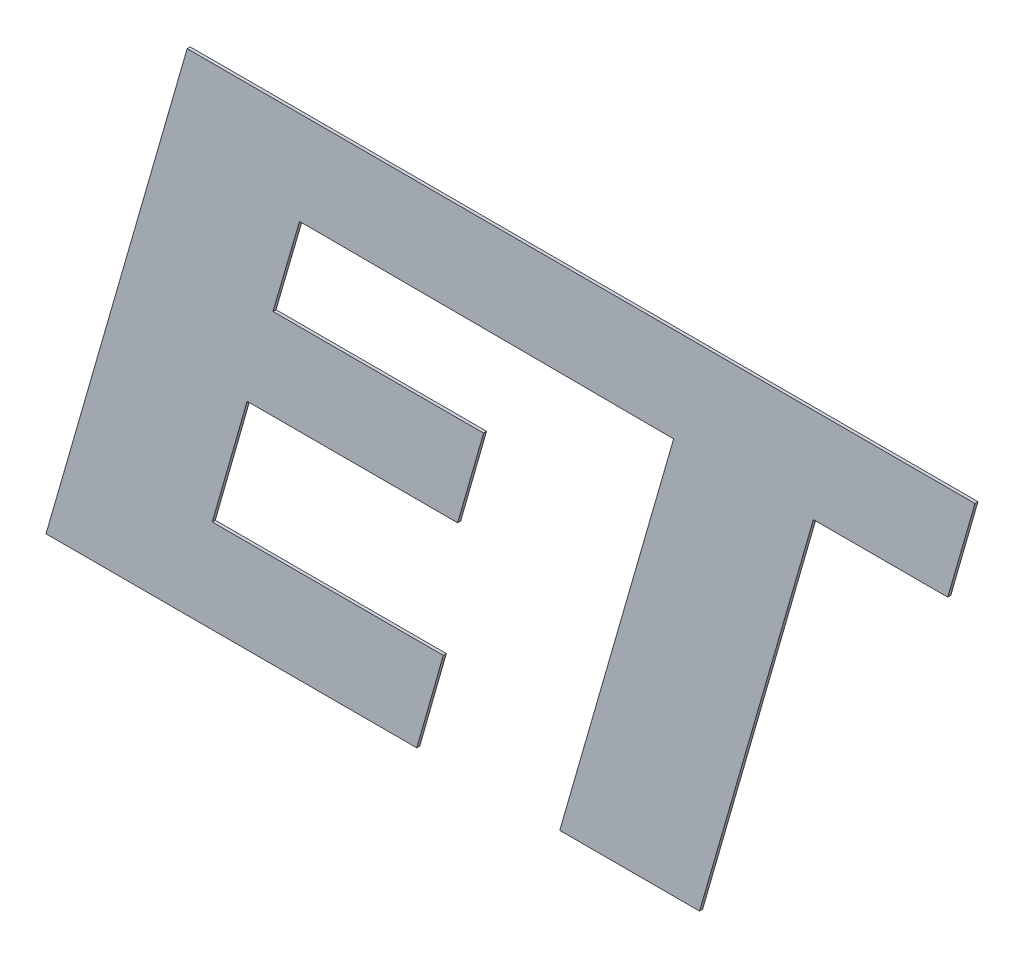
ISO-10303-21;
HEADER;
FILE_DESCRIPTION(('STEP AP214'),'2;1');
FILE_NAME('part.step','',(''),(''),'','','');
FILE_SCHEMA(('AUTOMOTIVE_DESIGN { 1 0 10303 214 1 1 1 1 }'));
ENDSEC;
DATA;
#1=APPLICATION_CONTEXT('core data for automotive mechanical design processes');
#2=APPLICATION_PROTOCOL_DEFINITION('international standard','automotive_design',2000,#1);
#3=PRODUCT_CONTEXT('',#1,'mechanical');
#4=PRODUCT('Part','Part','',(#3));
#5=PRODUCT_RELATED_PRODUCT_CATEGORY('part','',(#4));
#6=PRODUCT_DEFINITION_FORMATION('','',#4);
#7=PRODUCT_DEFINITION_CONTEXT('part definition',#1,'design');
#8=PRODUCT_DEFINITION('design','',#6,#7);
#9=PRODUCT_DEFINITION_SHAPE('','',#8);
#10=(LENGTH_UNIT() NAMED_UNIT(*) SI_UNIT(.MILLI.,.METRE.));
#11=(NAMED_UNIT(*) PLANE_ANGLE_UNIT() SI_UNIT($,.RADIAN.));
#12=(NAMED_UNIT(*) SI_UNIT($,.STERADIAN.) SOLID_ANGLE_UNIT());
#13=UNCERTAINTY_MEASURE_WITH_UNIT(LENGTH_MEASURE(1.E-05),#10,'distance_accuracy_value','');
#14=(GEOMETRIC_REPRESENTATION_CONTEXT(3) GLOBAL_UNCERTAINTY_ASSIGNED_CONTEXT((#13)) GLOBAL_UNIT_ASSIGNED_CONTEXT((#10,
#11,#12)) REPRESENTATION_CONTEXT('',''));
#15=CARTESIAN_POINT('',(0.,0.,0.));
#16=DIRECTION('',(0.,0.,1.));
#17=DIRECTION('',(1.,0.,0.));
#18=AXIS2_PLACEMENT_3D('',#15,#16,#17);
#19=CARTESIAN_POINT('',(4.5494598303716,3.44987790081049,2.505));
#20=DIRECTION('',(0.00281330167602132,0.99999604265901,0.));
#21=DIRECTION('',(0.,0.,-1.));
#22=AXIS2_PLACEMENT_3D('',#19,#20,#21);
#23=PLANE('',#22);
#24=DIRECTION('',(0.99999604265901,-0.00281330167602132,0.));
#25=VECTOR('',#24,1.);
#26=CARTESIAN_POINT('',(4.5494598303716,3.44987790081049,2.5));
#27=LINE('',#26,#25);
#28=CARTESIAN_POINT('',(4.5494598303716,3.44987790081049,2.5));
#29=VERTEX_POINT('',#28);
#30=CARTESIAN_POINT('',(4.91902481999534,3.44883819889133,2.5));
#31=VERTEX_POINT('',#30);
#32=EDGE_CURVE('E10',#29,#31,#27,.T.);
#33=ORIENTED_EDGE('',*,*,#32,.T.);
#34=DIRECTION('',(0.,0.,-1.));
#35=VECTOR('',#34,1.);
#36=CARTESIAN_POINT('',(4.91902481999534,3.44883819889133,2.505));
#37=LINE('',#36,#35);
#38=CARTESIAN_POINT('',(4.91902481999534,3.44883819889133,2.505));
#39=VERTEX_POINT('',#38);
#40=EDGE_CURVE('E42',#39,#31,#37,.T.);
#41=ORIENTED_EDGE('',*,*,#40,.F.);
#42=DIRECTION('',(0.99999604265901,-0.00281330167602132,0.));
#43=VECTOR('',#42,1.);
#44=CARTESIAN_POINT('',(4.5494598303716,3.44987790081049,2.505));
#45=LINE('',#44,#43);
#46=CARTESIAN_POINT('',(4.5494598303716,3.44987790081049,2.505));
#47=VERTEX_POINT('',#46);
#48=EDGE_CURVE('E274',#47,#39,#45,.T.);
#49=ORIENTED_EDGE('',*,*,#48,.F.);
#50=DIRECTION('',(0.,0.,-1.));
#51=VECTOR('',#50,1.);
#52=CARTESIAN_POINT('',(4.5494598303716,3.44987790081049,2.505));
#53=LINE('',#52,#51);
#54=EDGE_CURVE('E27',#47,#29,#53,.T.);
#55=ORIENTED_EDGE('',*,*,#54,.T.);
#56=EDGE_LOOP('',(#33,#41,#49,#55));
#57=FACE_BOUND('',#56,.T.);
#58=ADVANCED_FACE('F16',(#57),#23,.F.);
#59=CARTESIAN_POINT('',(4.91902481999534,3.44883819889133,2.505));
#60=DIRECTION('',(0.00465069382367867,0.999989185465002,0.));
#61=DIRECTION('',(0.,0.,-1.));
#62=AXIS2_PLACEMENT_3D('',#59,#60,#61);
#63=PLANE('',#62);
#64=DIRECTION('',(0.999989185465002,-0.00465069382367867,0.));
#65=VECTOR('',#64,1.);
#66=CARTESIAN_POINT('',(4.91902481999534,3.44883819889133,2.5));
#67=LINE('',#66,#65);
#68=CARTESIAN_POINT('',(5.16419830268063,3.44769795975852,2.5));
#69=VERTEX_POINT('',#68);
#70=EDGE_CURVE('E315',#31,#69,#67,.T.);
#71=ORIENTED_EDGE('',*,*,#70,.T.);
#72=DIRECTION('',(0.,0.,-1.));
#73=VECTOR('',#72,1.);
#74=CARTESIAN_POINT('',(5.16419830268063,3.44769795975852,2.505));
#75=LINE('',#74,#73);
#76=CARTESIAN_POINT('',(5.16419830268063,3.44769795975852,2.505));
#77=VERTEX_POINT('',#76);
#78=EDGE_CURVE('E233',#77,#69,#75,.T.);
#79=ORIENTED_EDGE('',*,*,#78,.F.);
#80=DIRECTION('',(0.999989185465002,-0.00465069382367867,0.));
#81=VECTOR('',#80,1.);
#82=CARTESIAN_POINT('',(4.91902481999534,3.44883819889133,2.505));
#83=LINE('',#82,#81);
#84=EDGE_CURVE('E271',#39,#77,#83,.T.);
#85=ORIENTED_EDGE('',*,*,#84,.F.);
#86=ORIENTED_EDGE('',*,*,#40,.T.);
#87=EDGE_LOOP('',(#71,#79,#85,#86));
#88=FACE_BOUND('',#87,.T.);
#89=ADVANCED_FACE('F428',(#88),#63,.F.);
#90=CARTESIAN_POINT('',(5.16419830268063,3.44769795975852,2.505));
#91=DIRECTION('',(0.961066454899901,-0.276317334356962,0.));
#92=DIRECTION('',(0.,0.,-1.));
#93=AXIS2_PLACEMENT_3D('',#90,#91,#92);
#94=PLANE('',#93);
#95=DIRECTION('',(-0.276317334356962,-0.961066454899901,0.));
#96=VECTOR('',#95,1.);
#97=CARTESIAN_POINT('',(5.16419830268063,3.44769795975852,2.5));
#98=LINE('',#97,#96);
#99=CARTESIAN_POINT('',(4.977100999823,2.79695,2.5));
#100=VERTEX_POINT('',#99);
#101=EDGE_CURVE('E306',#69,#100,#98,.T.);
#102=ORIENTED_EDGE('',*,*,#101,.T.);
#103=DIRECTION('',(0.,0.,-1.));
#104=VECTOR('',#103,1.);
#105=CARTESIAN_POINT('',(4.977100999823,2.79695,2.505));
#106=LINE('',#105,#104);
#107=CARTESIAN_POINT('',(4.977100999823,2.79695,2.505));
#108=VERTEX_POINT('',#107);
#109=EDGE_CURVE('E225',#108,#100,#106,.T.);
#110=ORIENTED_EDGE('',*,*,#109,.F.);
#111=DIRECTION('',(-0.276317334356962,-0.961066454899901,0.));
#112=VECTOR('',#111,1.);
#113=CARTESIAN_POINT('',(5.16419830268063,3.44769795975852,2.505));
#114=LINE('',#113,#112);
#115=EDGE_CURVE('E275',#77,#108,#114,.T.);
#116=ORIENTED_EDGE('',*,*,#115,.F.);
#117=ORIENTED_EDGE('',*,*,#78,.T.);
#118=EDGE_LOOP('',(#102,#110,#116,#117));
#119=FACE_BOUND('',#118,.T.);
#120=ADVANCED_FACE('F433',(#119),#94,.F.);
#121=CARTESIAN_POINT('',(4.977100999823,2.79695,2.505));
#122=DIRECTION('',(0.,1.,0.));
#123=DIRECTION('',(1.,0.,0.));
#124=AXIS2_PLACEMENT_3D('',#121,#122,#123);
#125=PLANE('',#124);
#126=DIRECTION('',(1.,0.,0.));
#127=VECTOR('',#126,1.);
#128=CARTESIAN_POINT('',(4.977100999823,2.79695,2.5));
#129=LINE('',#128,#127);
#130=CARTESIAN_POINT('',(5.20683098560959,2.79695,2.5));
#131=VERTEX_POINT('',#130);
#132=EDGE_CURVE('E229',#100,#131,#129,.T.);
#133=ORIENTED_EDGE('',*,*,#132,.T.);
#134=DIRECTION('',(0.,0.,-1.));
#135=VECTOR('',#134,1.);
#136=CARTESIAN_POINT('',(5.20683098560959,2.79695,2.505));
#137=LINE('',#136,#135);
#138=CARTESIAN_POINT('',(5.20683098560959,2.79695,2.505));
#139=VERTEX_POINT('',#138);
#140=EDGE_CURVE('E237',#139,#131,#137,.T.);
#141=ORIENTED_EDGE('',*,*,#140,.F.);
#142=DIRECTION('',(1.,0.,0.));
#143=VECTOR('',#142,1.);
#144=CARTESIAN_POINT('',(4.977100999823,2.79695,2.505));
#145=LINE('',#144,#143);
#146=EDGE_CURVE('E276',#108,#139,#145,.T.);
#147=ORIENTED_EDGE('',*,*,#146,.F.);
#148=ORIENTED_EDGE('',*,*,#109,.T.);
#149=EDGE_LOOP('',(#133,#141,#147,#148));
#150=FACE_BOUND('',#149,.T.);
#151=ADVANCED_FACE('F438',(#150),#125,.F.);
#152=CARTESIAN_POINT('',(5.20683098560959,2.79695,2.505));
#153=DIRECTION('',(-0.961087610217285,0.276243742891722,0.));
#154=DIRECTION('',(0.,0.,1.));
#155=AXIS2_PLACEMENT_3D('',#152,#153,#154);
#156=PLANE('',#155);
#157=DIRECTION('',(0.276243742891722,0.961087610217285,0.));
#158=VECTOR('',#157,1.);
#159=CARTESIAN_POINT('',(5.20683098560959,2.79695,2.5));
#160=LINE('',#159,#158);
#161=CARTESIAN_POINT('',(5.39387434166915,3.44769795975651,2.5));
#162=VERTEX_POINT('',#161);
#163=EDGE_CURVE('E234',#131,#162,#160,.T.);
#164=ORIENTED_EDGE('',*,*,#163,.T.);
#165=DIRECTION('',(0.,0.,-1.));
#166=VECTOR('',#165,1.);
#167=CARTESIAN_POINT('',(5.39387434166915,3.44769795975651,2.505));
#168=LINE('',#167,#166);
#169=CARTESIAN_POINT('',(5.39387434166915,3.44769795975651,2.505));
#170=VERTEX_POINT('',#169);
#171=EDGE_CURVE('E268',#170,#162,#168,.T.);
#172=ORIENTED_EDGE('',*,*,#171,.F.);
#173=DIRECTION('',(0.276243742891722,0.961087610217285,0.));
#174=VECTOR('',#173,1.);
#175=CARTESIAN_POINT('',(5.20683098560959,2.79695,2.505));
#176=LINE('',#175,#174);
#177=EDGE_CURVE('E279',#139,#170,#176,.T.);
#178=ORIENTED_EDGE('',*,*,#177,.F.);
#179=ORIENTED_EDGE('',*,*,#140,.T.);
#180=EDGE_LOOP('',(#164,#172,#178,#179));
#181=FACE_BOUND('',#180,.T.);
#182=ADVANCED_FACE('F18',(#181),#156,.F.);
#183=CARTESIAN_POINT('',(5.39387434166915,3.44769795975651,2.505));
#184=DIRECTION('',(7.938847109814E-05,0.999999996848735,0.));
#185=DIRECTION('',(0.,0.,-1.));
#186=AXIS2_PLACEMENT_3D('',#183,#184,#185);
#187=PLANE('',#186);
#188=DIRECTION('',(0.999999996848735,-7.93884710981399E-05,0.));
#189=VECTOR('',#188,1.);
#190=CARTESIAN_POINT('',(5.39387434166915,3.44769795975651,2.5));
#191=LINE('',#190,#189);
#192=CARTESIAN_POINT('',(5.61467578060134,3.4476804306678,2.5));
#193=VERTEX_POINT('',#192);
#194=EDGE_CURVE('E286',#162,#193,#191,.T.);
#195=ORIENTED_EDGE('',*,*,#194,.T.);
#196=DIRECTION('',(0.,0.,-1.));
#197=VECTOR('',#196,1.);
#198=CARTESIAN_POINT('',(5.61467578060134,3.4476804306678,2.505));
#199=LINE('',#198,#197);
#200=CARTESIAN_POINT('',(5.61467578060134,3.4476804306678,2.505));
#201=VERTEX_POINT('',#200);
#202=EDGE_CURVE('E269',#201,#193,#199,.T.);
#203=ORIENTED_EDGE('',*,*,#202,.F.);
#204=DIRECTION('',(0.999999996848735,-7.93884710981399E-05,0.));
#205=VECTOR('',#204,1.);
#206=CARTESIAN_POINT('',(5.39387434166915,3.44769795975651,2.505));
#207=LINE('',#206,#205);
#208=EDGE_CURVE('E296',#170,#201,#207,.T.);
#209=ORIENTED_EDGE('',*,*,#208,.F.);
#210=ORIENTED_EDGE('',*,*,#171,.T.);
#211=EDGE_LOOP('',(#195,#203,#209,#210));
#212=FACE_BOUND('',#211,.T.);
#213=ADVANCED_FACE('F604',(#212),#187,.F.);
#214=CARTESIAN_POINT('',(5.61467578060134,3.4476804306678,2.505));
#215=DIRECTION('',(-0.961099233430489,0.276203301029018,0.));
#216=DIRECTION('',(0.,0.,1.));
#217=AXIS2_PLACEMENT_3D('',#214,#215,#216);
#218=PLANE('',#217);
#219=DIRECTION('',(0.276203301029018,0.961099233430489,0.));
#220=VECTOR('',#219,1.);
#221=CARTESIAN_POINT('',(5.61467578060134,3.4476804306678,2.5));
#222=LINE('',#221,#220);
#223=CARTESIAN_POINT('',(5.65942990601665,3.60341048700408,2.5));
#224=VERTEX_POINT('',#223);
#225=EDGE_CURVE('E265',#193,#224,#222,.T.);
#226=ORIENTED_EDGE('',*,*,#225,.T.);
#227=DIRECTION('',(0.,0.,-1.));
#228=VECTOR('',#227,1.);
#229=CARTESIAN_POINT('',(5.65942990601665,3.60341048700408,2.505));
#230=LINE('',#229,#228);
#231=CARTESIAN_POINT('',(5.65942990601665,3.60341048700408,2.505));
#232=VERTEX_POINT('',#231);
#233=EDGE_CURVE('E242',#232,#224,#230,.T.);
#234=ORIENTED_EDGE('',*,*,#233,.F.);
#235=DIRECTION('',(0.276203301029018,0.961099233430489,0.));
#236=VECTOR('',#235,1.);
#237=CARTESIAN_POINT('',(5.61467578060134,3.4476804306678,2.505));
#238=LINE('',#237,#236);
#239=EDGE_CURVE('E293',#201,#232,#238,.T.);
#240=ORIENTED_EDGE('',*,*,#239,.F.);
#241=ORIENTED_EDGE('',*,*,#202,.T.);
#242=EDGE_LOOP('',(#226,#234,#240,#241));
#243=FACE_BOUND('',#242,.T.);
#244=ADVANCED_FACE('F403',(#243),#218,.F.);
#245=CARTESIAN_POINT('',(4.9634867904383,3.60341048700408,2.505));
#246=DIRECTION('',(0.,-1.,0.));
#247=DIRECTION('',(0.,0.,-1.));
#248=AXIS2_PLACEMENT_3D('',#245,#246,#247);
#249=PLANE('',#248);
#250=DIRECTION('',(-1.,0.,0.));
#251=VECTOR('',#250,1.);
#252=CARTESIAN_POINT('',(4.9634867904383,3.60341048700408,2.5));
#253=LINE('',#252,#251);
#254=CARTESIAN_POINT('',(4.36480484681998,3.60341048700408,2.5));
#255=VERTEX_POINT('',#254);
#256=EDGE_CURVE('E246',#224,#255,#253,.T.);
#257=ORIENTED_EDGE('',*,*,#256,.T.);
#258=DIRECTION('',(0.,0.,-1.));
#259=VECTOR('',#258,1.);
#260=CARTESIAN_POINT('',(4.36480484681998,3.60341048700408,2.505));
#261=LINE('',#260,#259);
#262=CARTESIAN_POINT('',(4.36480484681998,3.60341048700408,2.505));
#263=VERTEX_POINT('',#262);
#264=EDGE_CURVE('E251',#263,#255,#261,.T.);
#265=ORIENTED_EDGE('',*,*,#264,.F.);
#266=DIRECTION('',(-1.,0.,0.));
#267=VECTOR('',#266,1.);
#268=CARTESIAN_POINT('',(5.65942990601665,3.60341048700408,2.505));
#269=LINE('',#268,#267);
#270=EDGE_CURVE('E297',#232,#263,#269,.T.);
#271=ORIENTED_EDGE('',*,*,#270,.F.);
#272=ORIENTED_EDGE('',*,*,#233,.T.);
#273=EDGE_LOOP('',(#257,#265,#271,#272));
#274=FACE_BOUND('',#273,.T.);
#275=ADVANCED_FACE('F398',(#274),#249,.F.);
#276=CARTESIAN_POINT('',(4.36480484681998,3.60341048700408,2.505));
#277=DIRECTION('',(0.961034823670664,-0.276427328048977,0.));
#278=DIRECTION('',(0.,0.,-1.));
#279=AXIS2_PLACEMENT_3D('',#276,#277,#278);
#280=PLANE('',#279);
#281=DIRECTION('',(-0.276427328048977,-0.961034823670664,0.));
#282=VECTOR('',#281,1.);
#283=CARTESIAN_POINT('',(4.36480484681998,3.60341048700408,2.5));
#284=LINE('',#283,#282);
#285=CARTESIAN_POINT('',(4.1328385204093,2.79695,2.5));
#286=VERTEX_POINT('',#285);
#287=EDGE_CURVE('E247',#255,#286,#284,.T.);
#288=ORIENTED_EDGE('',*,*,#287,.T.);
#289=DIRECTION('',(0.,0.,-1.));
#290=VECTOR('',#289,1.);
#291=CARTESIAN_POINT('',(4.1328385204093,2.79695,2.505));
#292=LINE('',#291,#290);
#293=CARTESIAN_POINT('',(4.1328385204093,2.79695,2.505));
#294=VERTEX_POINT('',#293);
#295=EDGE_CURVE('E116',#294,#286,#292,.T.);
#296=ORIENTED_EDGE('',*,*,#295,.F.);
#297=DIRECTION('',(-0.276427328048977,-0.961034823670664,0.));
#298=VECTOR('',#297,1.);
#299=CARTESIAN_POINT('',(4.36480484681998,3.60341048700408,2.505));
#300=LINE('',#299,#298);
#301=EDGE_CURVE('E129',#263,#294,#300,.T.);
#302=ORIENTED_EDGE('',*,*,#301,.F.);
#303=ORIENTED_EDGE('',*,*,#264,.T.);
#304=EDGE_LOOP('',(#288,#296,#302,#303));
#305=FACE_BOUND('',#304,.T.);
#306=ADVANCED_FACE('F572',(#305),#280,.F.);
#307=CARTESIAN_POINT('',(4.1328385204093,2.79695,2.505));
#308=DIRECTION('',(0.,1.,0.));
#309=DIRECTION('',(1.,0.,0.));
#310=AXIS2_PLACEMENT_3D('',#307,#308,#309);
#311=PLANE('',#310);
#312=DIRECTION('',(1.,0.,0.));
#313=VECTOR('',#312,1.);
#314=CARTESIAN_POINT('',(4.1328385204093,2.79695,2.5));
#315=LINE('',#314,#313);
#316=CARTESIAN_POINT('',(4.74214307891592,2.79695,2.5));
#317=VERTEX_POINT('',#316);
#318=EDGE_CURVE('E248',#286,#317,#315,.T.);
#319=ORIENTED_EDGE('',*,*,#318,.T.);
#320=DIRECTION('',(0.,0.,-1.));
#321=VECTOR('',#320,1.);
#322=CARTESIAN_POINT('',(4.74214307891592,2.79695,2.505));
#323=LINE('',#322,#321);
#324=CARTESIAN_POINT('',(4.74214307891592,2.79695,2.505));
#325=VERTEX_POINT('',#324);
#326=EDGE_CURVE('E142',#325,#317,#323,.T.);
#327=ORIENTED_EDGE('',*,*,#326,.F.);
#328=DIRECTION('',(1.,0.,0.));
#329=VECTOR('',#328,1.);
#330=CARTESIAN_POINT('',(4.1328385204093,2.79695,2.505));
#331=LINE('',#330,#329);
#332=EDGE_CURVE('E307',#294,#325,#331,.T.);
#333=ORIENTED_EDGE('',*,*,#332,.F.);
#334=ORIENTED_EDGE('',*,*,#295,.T.);
#335=EDGE_LOOP('',(#319,#327,#333,#334));
#336=FACE_BOUND('',#335,.T.);
#337=ADVANCED_FACE('F409',(#336),#311,.F.);
#338=CARTESIAN_POINT('',(4.74214307891592,2.79695,2.505));
#339=DIRECTION('',(-0.962020079379883,0.272978693069485,0.));
#340=DIRECTION('',(0.,0.,1.));
#341=AXIS2_PLACEMENT_3D('',#338,#339,#340);
#342=PLANE('',#341);
#343=DIRECTION('',(0.272978693069485,0.962020079379883,0.));
#344=VECTOR('',#343,1.);
#345=CARTESIAN_POINT('',(4.74214307891592,2.79695,2.5));
#346=LINE('',#345,#344);
#347=CARTESIAN_POINT('',(4.78568795315105,2.95040902237722,2.5));
#348=VERTEX_POINT('',#347);
#349=EDGE_CURVE('E239',#317,#348,#346,.T.);
#350=ORIENTED_EDGE('',*,*,#349,.T.);
#351=DIRECTION('',(0.,0.,-1.));
#352=VECTOR('',#351,1.);
#353=CARTESIAN_POINT('',(4.78568795315105,2.95040902237722,2.505));
#354=LINE('',#353,#352);
#355=CARTESIAN_POINT('',(4.78568795315105,2.95040902237722,2.505));
#356=VERTEX_POINT('',#355);
#357=EDGE_CURVE('E257',#356,#348,#354,.T.);
#358=ORIENTED_EDGE('',*,*,#357,.F.);
#359=DIRECTION('',(0.272978693069485,0.962020079379883,0.));
#360=VECTOR('',#359,1.);
#361=CARTESIAN_POINT('',(4.74214307891592,2.79695,2.505));
#362=LINE('',#361,#360);
#363=EDGE_CURVE('E254',#325,#356,#362,.T.);
#364=ORIENTED_EDGE('',*,*,#363,.F.);
#365=ORIENTED_EDGE('',*,*,#326,.T.);
#366=EDGE_LOOP('',(#350,#358,#364,#365));
#367=FACE_BOUND('',#366,.T.);
#368=ADVANCED_FACE('F411',(#367),#342,.F.);
#369=CARTESIAN_POINT('',(4.78568795315105,2.95040902237722,2.505));
#370=DIRECTION('',(0.,-1.,0.));
#371=DIRECTION('',(0.,0.,-1.));
#372=AXIS2_PLACEMENT_3D('',#369,#370,#371);
#373=PLANE('',#372);
#374=DIRECTION('',(-1.,0.,0.));
#375=VECTOR('',#374,1.);
#376=CARTESIAN_POINT('',(4.78568795315105,2.95040902237722,2.5));
#377=LINE('',#376,#375);
#378=CARTESIAN_POINT('',(4.40606433788778,2.95040902237722,2.5));
#379=VERTEX_POINT('',#378);
#380=EDGE_CURVE('E287',#348,#379,#377,.T.);
#381=ORIENTED_EDGE('',*,*,#380,.T.);
#382=DIRECTION('',(0.,0.,-1.));
#383=VECTOR('',#382,1.);
#384=CARTESIAN_POINT('',(4.40606433788778,2.95040902237722,2.505));
#385=LINE('',#384,#383);
#386=CARTESIAN_POINT('',(4.40606433788778,2.95040902237722,2.505));
#387=VERTEX_POINT('',#386);
#388=EDGE_CURVE('E227',#387,#379,#385,.T.);
#389=ORIENTED_EDGE('',*,*,#388,.F.);
#390=DIRECTION('',(-1.,0.,0.));
#391=VECTOR('',#390,1.);
#392=CARTESIAN_POINT('',(4.78568795315105,2.95040902237722,2.505));
#393=LINE('',#392,#391);
#394=EDGE_CURVE('E193',#356,#387,#393,.T.);
#395=ORIENTED_EDGE('',*,*,#394,.F.);
#396=ORIENTED_EDGE('',*,*,#357,.T.);
#397=EDGE_LOOP('',(#381,#389,#395,#396));
#398=FACE_BOUND('',#397,.T.);
#399=ADVANCED_FACE('F413',(#398),#373,.F.);
#400=CARTESIAN_POINT('',(4.40606433788778,2.95040902237722,2.505));
#401=DIRECTION('',(-0.961582531986915,0.274515999857263,0.));
#402=DIRECTION('',(0.,0.,1.));
#403=AXIS2_PLACEMENT_3D('',#400,#401,#402);
#404=PLANE('',#403);
#405=DIRECTION('',(0.274515999857263,0.961582531986915,0.));
#406=VECTOR('',#405,1.);
#407=CARTESIAN_POINT('',(4.40606433788778,2.95040902237722,2.5));
#408=LINE('',#407,#406);
#409=CARTESIAN_POINT('',(4.46327736895301,3.15081647149841,2.5));
#410=VERTEX_POINT('',#409);
#411=EDGE_CURVE('E202',#379,#410,#408,.T.);
#412=ORIENTED_EDGE('',*,*,#411,.T.);
#413=DIRECTION('',(0.,0.,-1.));
#414=VECTOR('',#413,1.);
#415=CARTESIAN_POINT('',(4.46327736895301,3.15081647149841,2.505));
#416=LINE('',#415,#414);
#417=CARTESIAN_POINT('',(4.46327736895301,3.15081647149841,2.505));
#418=VERTEX_POINT('',#417);
#419=EDGE_CURVE('E199',#418,#410,#416,.T.);
#420=ORIENTED_EDGE('',*,*,#419,.F.);
#421=DIRECTION('',(0.274515999857263,0.961582531986915,0.));
#422=VECTOR('',#421,1.);
#423=CARTESIAN_POINT('',(4.40606433788778,2.95040902237722,2.505));
#424=LINE('',#423,#422);
#425=EDGE_CURVE('E185',#387,#418,#424,.T.);
#426=ORIENTED_EDGE('',*,*,#425,.F.);
#427=ORIENTED_EDGE('',*,*,#388,.T.);
#428=EDGE_LOOP('',(#412,#420,#426,#427));
#429=FACE_BOUND('',#428,.T.);
#430=ADVANCED_FACE('F200',(#429),#404,.F.);
#431=CARTESIAN_POINT('',(4.46327736895301,3.15081647149841,2.505));
#432=DIRECTION('',(0.,1.,0.));
#433=DIRECTION('',(1.,0.,0.));
#434=AXIS2_PLACEMENT_3D('',#431,#432,#433);
#435=PLANE('',#434);
#436=DIRECTION('',(1.,0.,0.));
#437=VECTOR('',#436,1.);
#438=CARTESIAN_POINT('',(4.46327736895301,3.15081647149841,2.5));
#439=LINE('',#438,#437);
#440=CARTESIAN_POINT('',(4.80931665053439,3.15081647149841,2.5));
#441=VERTEX_POINT('',#440);
#442=EDGE_CURVE('E207',#410,#441,#439,.T.);
#443=ORIENTED_EDGE('',*,*,#442,.T.);
#444=DIRECTION('',(0.,0.,-1.));
#445=VECTOR('',#444,1.);
#446=CARTESIAN_POINT('',(4.80931665053439,3.15081647149841,2.505));
#447=LINE('',#446,#445);
#448=CARTESIAN_POINT('',(4.80931665053439,3.15081647149841,2.505));
#449=VERTEX_POINT('',#448);
#450=EDGE_CURVE('E211',#449,#441,#447,.T.);
#451=ORIENTED_EDGE('',*,*,#450,.F.);
#452=DIRECTION('',(1.,0.,0.));
#453=VECTOR('',#452,1.);
#454=CARTESIAN_POINT('',(4.46327736895301,3.15081647149841,2.505));
#455=LINE('',#454,#453);
#456=EDGE_CURVE('E190',#418,#449,#455,.T.);
#457=ORIENTED_EDGE('',*,*,#456,.F.);
#458=ORIENTED_EDGE('',*,*,#419,.T.);
#459=EDGE_LOOP('',(#443,#451,#457,#458));
#460=FACE_BOUND('',#459,.T.);
#461=ADVANCED_FACE('F210',(#460),#435,.F.);
#462=CARTESIAN_POINT('',(4.80931665053439,3.15081647149841,2.505));
#463=DIRECTION('',(-0.961532303768429,0.274691879766727,0.));
#464=DIRECTION('',(0.,0.,1.));
#465=AXIS2_PLACEMENT_3D('',#462,#463,#464);
#466=PLANE('',#465);
#467=DIRECTION('',(0.274691879766727,0.961532303768429,0.));
#468=VECTOR('',#467,1.);
#469=CARTESIAN_POINT('',(4.80931665053439,3.15081647149841,2.5));
#470=LINE('',#469,#468);
#471=CARTESIAN_POINT('',(4.85190029092009,3.29987637773838,2.5));
#472=VERTEX_POINT('',#471);
#473=EDGE_CURVE('E208',#441,#472,#470,.T.);
#474=ORIENTED_EDGE('',*,*,#473,.T.);
#475=DIRECTION('',(0.,0.,-1.));
#476=VECTOR('',#475,1.);
#477=CARTESIAN_POINT('',(4.85190029092009,3.29987637773838,2.505));
#478=LINE('',#477,#476);
#479=CARTESIAN_POINT('',(4.85190029092009,3.29987637773838,2.505));
#480=VERTEX_POINT('',#479);
#481=EDGE_CURVE('E264',#480,#472,#478,.T.);
#482=ORIENTED_EDGE('',*,*,#481,.F.);
#483=DIRECTION('',(0.274691879766727,0.961532303768429,0.));
#484=VECTOR('',#483,1.);
#485=CARTESIAN_POINT('',(4.80931665053439,3.15081647149841,2.505));
#486=LINE('',#485,#484);
#487=EDGE_CURVE('E214',#449,#480,#486,.T.);
#488=ORIENTED_EDGE('',*,*,#487,.F.);
#489=ORIENTED_EDGE('',*,*,#450,.T.);
#490=EDGE_LOOP('',(#474,#482,#488,#489));
#491=FACE_BOUND('',#490,.T.);
#492=ADVANCED_FACE('F415',(#491),#466,.F.);
#493=CARTESIAN_POINT('',(4.85190029092009,3.29987637773838,2.505));
#494=DIRECTION('',(0.,-1.,0.));
#495=DIRECTION('',(0.,0.,-1.));
#496=AXIS2_PLACEMENT_3D('',#493,#494,#495);
#497=PLANE('',#496);
#498=DIRECTION('',(-1.,0.,0.));
#499=VECTOR('',#498,1.);
#500=CARTESIAN_POINT('',(4.85190029092009,3.29987637773838,2.5));
#501=LINE('',#500,#499);
#502=CARTESIAN_POINT('',(4.50581196679536,3.29987637773838,2.5));
#503=VERTEX_POINT('',#502);
#504=EDGE_CURVE('E260',#472,#503,#501,.T.);
#505=ORIENTED_EDGE('',*,*,#504,.T.);
#506=DIRECTION('',(0.,0.,-1.));
#507=VECTOR('',#506,1.);
#508=CARTESIAN_POINT('',(4.50581196679536,3.29987637773838,2.505));
#509=LINE('',#508,#507);
#510=CARTESIAN_POINT('',(4.50581196679536,3.29987637773838,2.505));
#511=VERTEX_POINT('',#510);
#512=EDGE_CURVE('E20',#511,#503,#509,.T.);
#513=ORIENTED_EDGE('',*,*,#512,.F.);
#514=DIRECTION('',(-1.,0.,0.));
#515=VECTOR('',#514,1.);
#516=CARTESIAN_POINT('',(4.85190029092009,3.29987637773838,2.505));
#517=LINE('',#516,#515);
#518=EDGE_CURVE('E221',#480,#511,#517,.T.);
#519=ORIENTED_EDGE('',*,*,#518,.F.);
#520=ORIENTED_EDGE('',*,*,#481,.T.);
#521=EDGE_LOOP('',(#505,#513,#519,#520));
#522=FACE_BOUND('',#521,.T.);
#523=ADVANCED_FACE('F377',(#522),#497,.F.);
#524=CARTESIAN_POINT('',(4.50581196679536,3.29987637773838,2.505));
#525=DIRECTION('',(-0.960176311434603,0.279394794081492,0.));
#526=DIRECTION('',(0.,0.,1.));
#527=AXIS2_PLACEMENT_3D('',#524,#525,#526);
#528=PLANE('',#527);
#529=DIRECTION('',(0.279394794081492,0.960176311434603,0.));
#530=VECTOR('',#529,1.);
#531=CARTESIAN_POINT('',(4.50581196679536,3.29987637773838,2.5));
#532=LINE('',#531,#530);
#533=EDGE_CURVE('E298',#503,#29,#532,.T.);
#534=ORIENTED_EDGE('',*,*,#533,.T.);
#535=ORIENTED_EDGE('',*,*,#54,.F.);
#536=DIRECTION('',(0.279394794081492,0.960176311434603,0.));
#537=VECTOR('',#536,1.);
#538=CARTESIAN_POINT('',(4.50581196679536,3.29987637773838,2.505));
#539=LINE('',#538,#537);
#540=EDGE_CURVE('E280',#511,#47,#539,.T.);
#541=ORIENTED_EDGE('',*,*,#540,.F.);
#542=ORIENTED_EDGE('',*,*,#512,.T.);
#543=EDGE_LOOP('',(#534,#535,#541,#542));
#544=FACE_BOUND('',#543,.T.);
#545=ADVANCED_FACE('F371',(#544),#528,.F.);
#546=CARTESIAN_POINT('',(-0.0875343276926901,0.18669957358834,2.505));
#547=DIRECTION('',(0.,0.,1.));
#548=DIRECTION('',(1.,0.,0.));
#549=AXIS2_PLACEMENT_3D('',#546,#547,#548);
#550=PLANE('',#549);
#551=ORIENTED_EDGE('',*,*,#48,.T.);
#552=ORIENTED_EDGE('',*,*,#84,.T.);
#553=ORIENTED_EDGE('',*,*,#115,.T.);
#554=ORIENTED_EDGE('',*,*,#146,.T.);
#555=ORIENTED_EDGE('',*,*,#177,.T.);
#556=ORIENTED_EDGE('',*,*,#208,.T.);
#557=ORIENTED_EDGE('',*,*,#239,.T.);
#558=ORIENTED_EDGE('',*,*,#270,.T.);
#559=ORIENTED_EDGE('',*,*,#301,.T.);
#560=ORIENTED_EDGE('',*,*,#332,.T.);
#561=ORIENTED_EDGE('',*,*,#363,.T.);
#562=ORIENTED_EDGE('',*,*,#394,.T.);
#563=ORIENTED_EDGE('',*,*,#425,.T.);
#564=ORIENTED_EDGE('',*,*,#456,.T.);
#565=ORIENTED_EDGE('',*,*,#487,.T.);
#566=ORIENTED_EDGE('',*,*,#518,.T.);
#567=ORIENTED_EDGE('',*,*,#540,.T.);
#568=EDGE_LOOP('',(#551,#552,#553,#554,#555,#556,#557,#558,#559,#560,#561,#562,#563,#564,#565,
#566,#567));
#569=FACE_BOUND('',#568,.T.);
#570=ADVANCED_FACE('F187',(#569),#550,.T.);
#571=CARTESIAN_POINT('',(-0.0875343276926901,0.18669957358834,2.5));
#572=DIRECTION('',(0.,0.,1.));
#573=DIRECTION('',(1.,0.,0.));
#574=AXIS2_PLACEMENT_3D('',#571,#572,#573);
#575=PLANE('',#574);
#576=ORIENTED_EDGE('',*,*,#32,.F.);
#577=ORIENTED_EDGE('',*,*,#533,.F.);
#578=ORIENTED_EDGE('',*,*,#504,.F.);
#579=ORIENTED_EDGE('',*,*,#473,.F.);
#580=ORIENTED_EDGE('',*,*,#442,.F.);
#581=ORIENTED_EDGE('',*,*,#411,.F.);
#582=ORIENTED_EDGE('',*,*,#380,.F.);
#583=ORIENTED_EDGE('',*,*,#349,.F.);
#584=ORIENTED_EDGE('',*,*,#318,.F.);
#585=ORIENTED_EDGE('',*,*,#287,.F.);
#586=ORIENTED_EDGE('',*,*,#256,.F.);
#587=ORIENTED_EDGE('',*,*,#225,.F.);
#588=ORIENTED_EDGE('',*,*,#194,.F.);
#589=ORIENTED_EDGE('',*,*,#163,.F.);
#590=ORIENTED_EDGE('',*,*,#132,.F.);
#591=ORIENTED_EDGE('',*,*,#101,.F.);
#592=ORIENTED_EDGE('',*,*,#70,.F.);
#593=EDGE_LOOP('',(#576,#577,#578,#579,#580,#581,#582,#583,#584,#585,#586,#587,#588,#589,#590,
#591,#592));
#594=FACE_BOUND('',#593,.T.);
#595=ADVANCED_FACE('F382',(#594),#575,.F.);
#596=CLOSED_SHELL('',(#58,#89,#120,#151,#182,#213,#244,#275,#306,#337,#368,#399,#430,#461,#492,
#523,#545,#570,#595));
#597=MANIFOLD_SOLID_BREP('B1',#596);
#598=ADVANCED_BREP_SHAPE_REPRESENTATION('',(#18,#597),#14);
#599=SHAPE_DEFINITION_REPRESENTATION(#9,#598);
ENDSEC;
END-ISO-10303-21;
